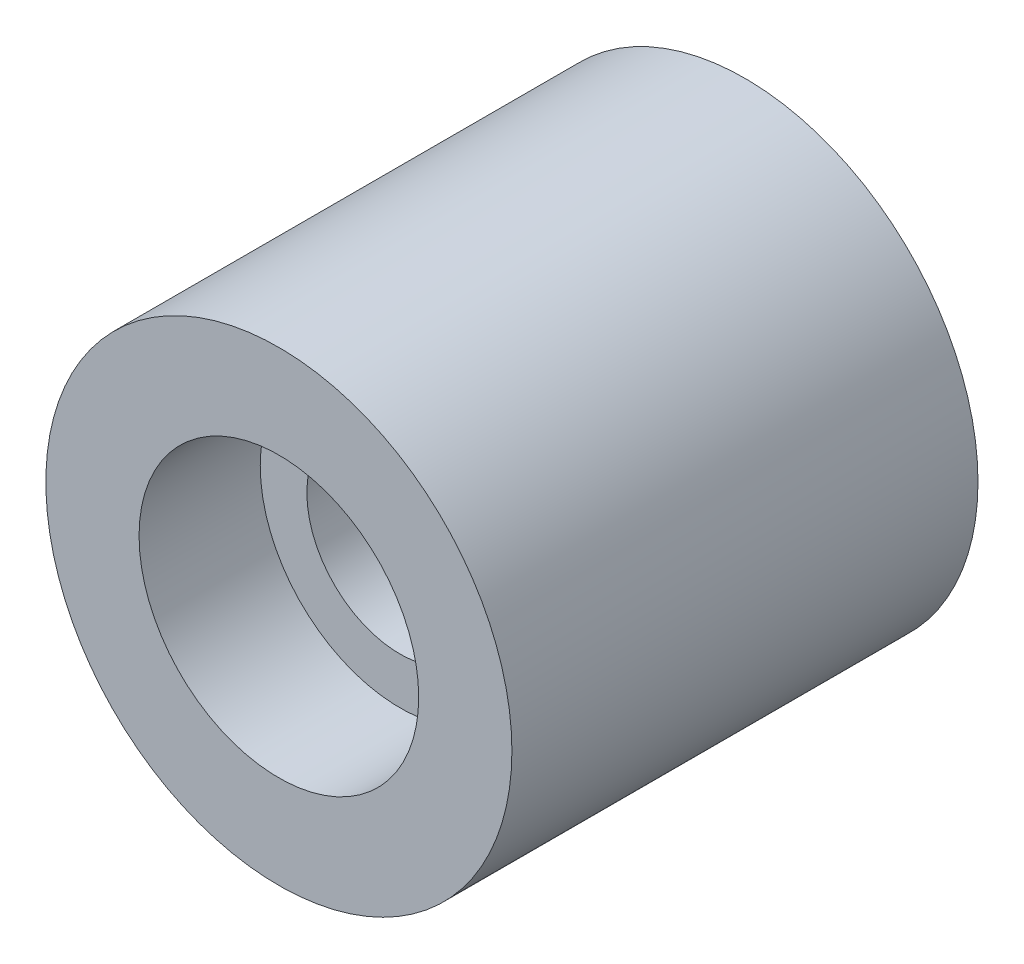
ISO-10303-21;
HEADER;
FILE_DESCRIPTION(('STEP AP214'),'2;1');
FILE_NAME('part.step','',(''),(''),'','','');
FILE_SCHEMA(('AUTOMOTIVE_DESIGN { 1 0 10303 214 1 1 1 1 }'));
ENDSEC;
DATA;
#1=APPLICATION_CONTEXT('core data for automotive mechanical design processes');
#2=APPLICATION_PROTOCOL_DEFINITION('international standard','automotive_design',2000,#1);
#3=PRODUCT_CONTEXT('',#1,'mechanical');
#4=PRODUCT('Part','Part','',(#3));
#5=PRODUCT_RELATED_PRODUCT_CATEGORY('part','',(#4));
#6=PRODUCT_DEFINITION_FORMATION('','',#4);
#7=PRODUCT_DEFINITION_CONTEXT('part definition',#1,'design');
#8=PRODUCT_DEFINITION('design','',#6,#7);
#9=PRODUCT_DEFINITION_SHAPE('','',#8);
#10=(LENGTH_UNIT() NAMED_UNIT(*) SI_UNIT(.MILLI.,.METRE.));
#11=(NAMED_UNIT(*) PLANE_ANGLE_UNIT() SI_UNIT($,.RADIAN.));
#12=(NAMED_UNIT(*) SI_UNIT($,.STERADIAN.) SOLID_ANGLE_UNIT());
#13=UNCERTAINTY_MEASURE_WITH_UNIT(LENGTH_MEASURE(1.E-05),#10,'distance_accuracy_value','');
#14=(GEOMETRIC_REPRESENTATION_CONTEXT(3) GLOBAL_UNCERTAINTY_ASSIGNED_CONTEXT((#13)) GLOBAL_UNIT_ASSIGNED_CONTEXT((#10,
#11,#12)) REPRESENTATION_CONTEXT('',''));
#15=CARTESIAN_POINT('',(0.,0.,0.));
#16=DIRECTION('',(0.,0.,1.));
#17=DIRECTION('',(1.,0.,0.));
#18=AXIS2_PLACEMENT_3D('',#15,#16,#17);
#19=CARTESIAN_POINT('',(0.,0.,0.));
#20=DIRECTION('',(0.,0.,1.));
#21=DIRECTION('',(1.,0.,0.));
#22=AXIS2_PLACEMENT_3D('',#19,#20,#21);
#23=CYLINDRICAL_SURFACE('',#22,1.5);
#24=CARTESIAN_POINT('',(0.,0.,-1.3));
#25=DIRECTION('',(0.,0.,1.));
#26=DIRECTION('',(1.,0.,0.));
#27=AXIS2_PLACEMENT_3D('',#24,#25,#26);
#28=CIRCLE('',#27,1.5);
#29=CARTESIAN_POINT('',(1.5,0.,-1.3));
#30=VERTEX_POINT('',#29);
#31=EDGE_CURVE('E65',#30,#30,#28,.T.);
#32=ORIENTED_EDGE('',*,*,#31,.F.);
#33=EDGE_LOOP('',(#32));
#34=FACE_BOUND('',#33,.T.);
#35=CARTESIAN_POINT('',(0.,0.,0.));
#36=DIRECTION('',(0.,0.,1.));
#37=DIRECTION('',(1.,0.,0.));
#38=AXIS2_PLACEMENT_3D('',#35,#36,#37);
#39=CIRCLE('',#38,1.5);
#40=CARTESIAN_POINT('',(1.5,0.,0.));
#41=VERTEX_POINT('',#40);
#42=EDGE_CURVE('E10',#41,#41,#39,.T.);
#43=ORIENTED_EDGE('',*,*,#42,.T.);
#44=EDGE_LOOP('',(#43));
#45=FACE_BOUND('',#44,.T.);
#46=ADVANCED_FACE('F31',(#34,#45),#23,.F.);
#47=CARTESIAN_POINT('',(-1.5,0.,0.));
#48=DIRECTION('',(0.,0.,-1.));
#49=DIRECTION('',(-1.,0.,0.));
#50=AXIS2_PLACEMENT_3D('',#47,#48,#49);
#51=PLANE('',#50);
#52=ORIENTED_EDGE('',*,*,#42,.F.);
#53=EDGE_LOOP('',(#52));
#54=FACE_BOUND('',#53,.T.);
#55=CARTESIAN_POINT('',(0.,0.,0.));
#56=DIRECTION('',(0.,0.,1.));
#57=DIRECTION('',(1.,0.,0.));
#58=AXIS2_PLACEMENT_3D('',#55,#56,#57);
#59=CIRCLE('',#58,2.5);
#60=CARTESIAN_POINT('',(2.5,0.,0.));
#61=VERTEX_POINT('',#60);
#62=EDGE_CURVE('E37',#61,#61,#59,.T.);
#63=ORIENTED_EDGE('',*,*,#62,.T.);
#64=EDGE_LOOP('',(#63));
#65=FACE_BOUND('',#64,.T.);
#66=ADVANCED_FACE('F72',(#54,#65),#51,.F.);
#67=CARTESIAN_POINT('',(0.,0.,0.));
#68=DIRECTION('',(0.,0.,1.));
#69=DIRECTION('',(1.,0.,0.));
#70=AXIS2_PLACEMENT_3D('',#67,#68,#69);
#71=CYLINDRICAL_SURFACE('',#70,2.5);
#72=ORIENTED_EDGE('',*,*,#62,.F.);
#73=EDGE_LOOP('',(#72));
#74=FACE_BOUND('',#73,.T.);
#75=CARTESIAN_POINT('',(0.,0.,-5.));
#76=DIRECTION('',(0.,0.,1.));
#77=DIRECTION('',(1.,0.,0.));
#78=AXIS2_PLACEMENT_3D('',#75,#76,#77);
#79=CIRCLE('',#78,2.5);
#80=CARTESIAN_POINT('',(2.5,0.,-5.));
#81=VERTEX_POINT('',#80);
#82=EDGE_CURVE('E41',#81,#81,#79,.T.);
#83=ORIENTED_EDGE('',*,*,#82,.T.);
#84=EDGE_LOOP('',(#83));
#85=FACE_BOUND('',#84,.T.);
#86=ADVANCED_FACE('F76',(#74,#85),#71,.T.);
#87=CARTESIAN_POINT('',(-2.5,0.,-5.));
#88=DIRECTION('',(0.,0.,1.));
#89=DIRECTION('',(1.,0.,0.));
#90=AXIS2_PLACEMENT_3D('',#87,#88,#89);
#91=PLANE('',#90);
#92=ORIENTED_EDGE('',*,*,#82,.F.);
#93=EDGE_LOOP('',(#92));
#94=FACE_BOUND('',#93,.T.);
#95=CARTESIAN_POINT('',(0.,0.,-5.));
#96=DIRECTION('',(0.,0.,1.));
#97=DIRECTION('',(1.,0.,0.));
#98=AXIS2_PLACEMENT_3D('',#95,#96,#97);
#99=CIRCLE('',#98,1.);
#100=CARTESIAN_POINT('',(1.,0.,-5.));
#101=VERTEX_POINT('',#100);
#102=EDGE_CURVE('E45',#101,#101,#99,.T.);
#103=ORIENTED_EDGE('',*,*,#102,.T.);
#104=EDGE_LOOP('',(#103));
#105=FACE_BOUND('',#104,.T.);
#106=ADVANCED_FACE('F81',(#94,#105),#91,.F.);
#107=CARTESIAN_POINT('',(0.,0.,0.));
#108=DIRECTION('',(0.,0.,1.));
#109=DIRECTION('',(1.,0.,0.));
#110=AXIS2_PLACEMENT_3D('',#107,#108,#109);
#111=CYLINDRICAL_SURFACE('',#110,1.);
#112=ORIENTED_EDGE('',*,*,#102,.F.);
#113=EDGE_LOOP('',(#112));
#114=FACE_BOUND('',#113,.T.);
#115=CARTESIAN_POINT('',(0.,0.,-4.5));
#116=DIRECTION('',(0.,0.,1.));
#117=DIRECTION('',(1.,0.,0.));
#118=AXIS2_PLACEMENT_3D('',#115,#116,#117);
#119=CIRCLE('',#118,1.);
#120=CARTESIAN_POINT('',(1.,0.,-4.5));
#121=VERTEX_POINT('',#120);
#122=EDGE_CURVE('E50',#121,#121,#119,.T.);
#123=ORIENTED_EDGE('',*,*,#122,.T.);
#124=EDGE_LOOP('',(#123));
#125=FACE_BOUND('',#124,.T.);
#126=ADVANCED_FACE('F87',(#114,#125),#111,.F.);
#127=CARTESIAN_POINT('',(-2.,0.,-4.5));
#128=DIRECTION('',(0.,0.,-1.));
#129=DIRECTION('',(-1.,0.,0.));
#130=AXIS2_PLACEMENT_3D('',#127,#128,#129);
#131=PLANE('',#130);
#132=ORIENTED_EDGE('',*,*,#122,.F.);
#133=EDGE_LOOP('',(#132));
#134=FACE_BOUND('',#133,.T.);
#135=CARTESIAN_POINT('',(0.,0.,-4.5));
#136=DIRECTION('',(0.,0.,1.));
#137=DIRECTION('',(1.,0.,0.));
#138=AXIS2_PLACEMENT_3D('',#135,#136,#137);
#139=CIRCLE('',#138,2.);
#140=CARTESIAN_POINT('',(2.,0.,-4.5));
#141=VERTEX_POINT('',#140);
#142=EDGE_CURVE('E53',#141,#141,#139,.T.);
#143=ORIENTED_EDGE('',*,*,#142,.T.);
#144=EDGE_LOOP('',(#143));
#145=FACE_BOUND('',#144,.T.);
#146=ADVANCED_FACE('F91',(#134,#145),#131,.F.);
#147=CARTESIAN_POINT('',(0.,0.,0.));
#148=DIRECTION('',(0.,0.,1.));
#149=DIRECTION('',(1.,0.,0.));
#150=AXIS2_PLACEMENT_3D('',#147,#148,#149);
#151=CYLINDRICAL_SURFACE('',#150,2.);
#152=ORIENTED_EDGE('',*,*,#142,.F.);
#153=EDGE_LOOP('',(#152));
#154=FACE_BOUND('',#153,.T.);
#155=CARTESIAN_POINT('',(0.,0.,-1.8));
#156=DIRECTION('',(0.,0.,1.));
#157=DIRECTION('',(1.,0.,0.));
#158=AXIS2_PLACEMENT_3D('',#155,#156,#157);
#159=CIRCLE('',#158,2.);
#160=CARTESIAN_POINT('',(2.,0.,-1.8));
#161=VERTEX_POINT('',#160);
#162=EDGE_CURVE('E56',#161,#161,#159,.T.);
#163=ORIENTED_EDGE('',*,*,#162,.T.);
#164=EDGE_LOOP('',(#163));
#165=FACE_BOUND('',#164,.T.);
#166=ADVANCED_FACE('F95',(#154,#165),#151,.F.);
#167=CARTESIAN_POINT('',(-2.,0.,-1.8));
#168=DIRECTION('',(0.,0.,1.));
#169=DIRECTION('',(1.,0.,0.));
#170=AXIS2_PLACEMENT_3D('',#167,#168,#169);
#171=PLANE('',#170);
#172=ORIENTED_EDGE('',*,*,#162,.F.);
#173=EDGE_LOOP('',(#172));
#174=FACE_BOUND('',#173,.T.);
#175=CARTESIAN_POINT('',(0.,0.,-1.8));
#176=DIRECTION('',(0.,0.,1.));
#177=DIRECTION('',(1.,0.,0.));
#178=AXIS2_PLACEMENT_3D('',#175,#176,#177);
#179=CIRCLE('',#178,1.);
#180=CARTESIAN_POINT('',(1.,0.,-1.8));
#181=VERTEX_POINT('',#180);
#182=EDGE_CURVE('E59',#181,#181,#179,.T.);
#183=ORIENTED_EDGE('',*,*,#182,.T.);
#184=EDGE_LOOP('',(#183));
#185=FACE_BOUND('',#184,.T.);
#186=ADVANCED_FACE('F99',(#174,#185),#171,.F.);
#187=CARTESIAN_POINT('',(0.,0.,0.));
#188=DIRECTION('',(0.,0.,1.));
#189=DIRECTION('',(1.,0.,0.));
#190=AXIS2_PLACEMENT_3D('',#187,#188,#189);
#191=CYLINDRICAL_SURFACE('',#190,1.);
#192=ORIENTED_EDGE('',*,*,#182,.F.);
#193=EDGE_LOOP('',(#192));
#194=FACE_BOUND('',#193,.T.);
#195=CARTESIAN_POINT('',(0.,0.,-1.3));
#196=DIRECTION('',(0.,0.,1.));
#197=DIRECTION('',(1.,0.,0.));
#198=AXIS2_PLACEMENT_3D('',#195,#196,#197);
#199=CIRCLE('',#198,1.);
#200=CARTESIAN_POINT('',(1.,0.,-1.3));
#201=VERTEX_POINT('',#200);
#202=EDGE_CURVE('E62',#201,#201,#199,.T.);
#203=ORIENTED_EDGE('',*,*,#202,.T.);
#204=EDGE_LOOP('',(#203));
#205=FACE_BOUND('',#204,.T.);
#206=ADVANCED_FACE('F103',(#194,#205),#191,.F.);
#207=CARTESIAN_POINT('',(-1.5,0.,-1.3));
#208=DIRECTION('',(0.,0.,-1.));
#209=DIRECTION('',(-1.,0.,0.));
#210=AXIS2_PLACEMENT_3D('',#207,#208,#209);
#211=PLANE('',#210);
#212=ORIENTED_EDGE('',*,*,#202,.F.);
#213=EDGE_LOOP('',(#212));
#214=FACE_BOUND('',#213,.T.);
#215=ORIENTED_EDGE('',*,*,#31,.T.);
#216=EDGE_LOOP('',(#215));
#217=FACE_BOUND('',#216,.T.);
#218=ADVANCED_FACE('F69',(#214,#217),#211,.F.);
#219=CLOSED_SHELL('',(#46,#66,#86,#106,#126,#146,#166,#186,#206,#218));
#220=MANIFOLD_SOLID_BREP('B2',#219);
#221=ADVANCED_BREP_SHAPE_REPRESENTATION('',(#18,#220),#14);
#222=SHAPE_DEFINITION_REPRESENTATION(#9,#221);
ENDSEC;
END-ISO-10303-21;
